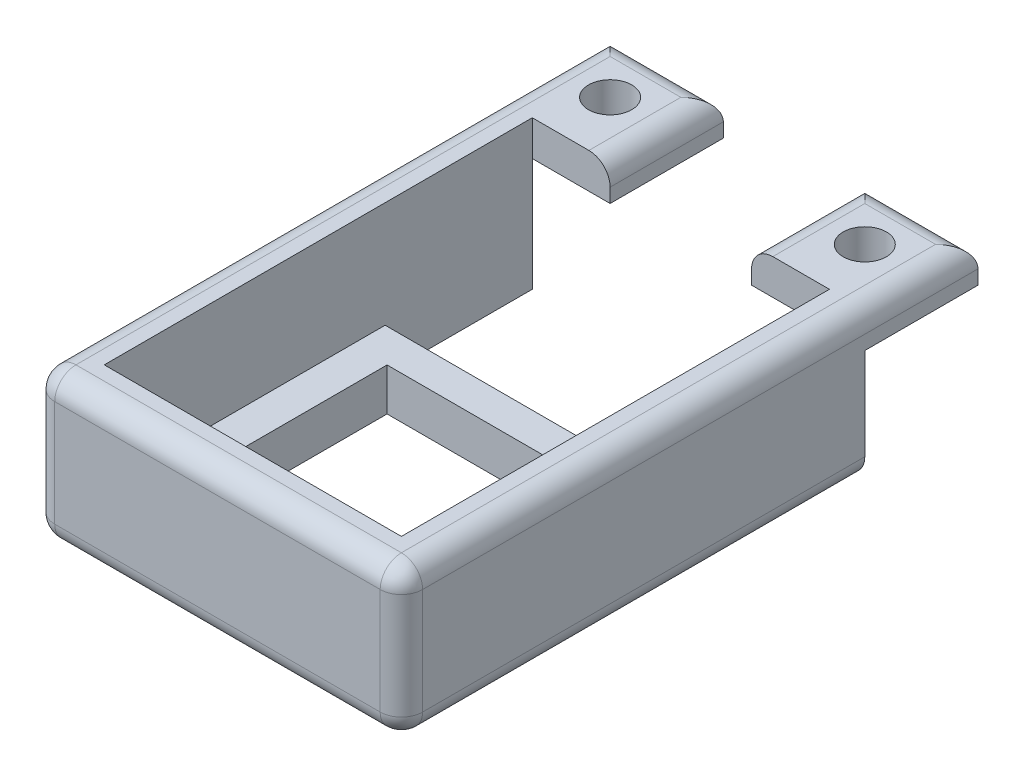
ISO-10303-21;
HEADER;
FILE_DESCRIPTION(('STEP AP214'),'2;1');
FILE_NAME('part.step','',(''),(''),'','','');
FILE_SCHEMA(('AUTOMOTIVE_DESIGN { 1 0 10303 214 1 1 1 1 }'));
ENDSEC;
DATA;
#1=APPLICATION_CONTEXT('core data for automotive mechanical design processes');
#2=APPLICATION_PROTOCOL_DEFINITION('international standard','automotive_design',2000,#1);
#3=PRODUCT_CONTEXT('',#1,'mechanical');
#4=PRODUCT('Part','Part','',(#3));
#5=PRODUCT_RELATED_PRODUCT_CATEGORY('part','',(#4));
#6=PRODUCT_DEFINITION_FORMATION('','',#4);
#7=PRODUCT_DEFINITION_CONTEXT('part definition',#1,'design');
#8=PRODUCT_DEFINITION('design','',#6,#7);
#9=PRODUCT_DEFINITION_SHAPE('','',#8);
#10=(LENGTH_UNIT() NAMED_UNIT(*) SI_UNIT(.MILLI.,.METRE.));
#11=(NAMED_UNIT(*) PLANE_ANGLE_UNIT() SI_UNIT($,.RADIAN.));
#12=(NAMED_UNIT(*) SI_UNIT($,.STERADIAN.) SOLID_ANGLE_UNIT());
#13=UNCERTAINTY_MEASURE_WITH_UNIT(LENGTH_MEASURE(1.E-05),#10,'distance_accuracy_value','');
#14=(GEOMETRIC_REPRESENTATION_CONTEXT(3) GLOBAL_UNCERTAINTY_ASSIGNED_CONTEXT((#13)) GLOBAL_UNIT_ASSIGNED_CONTEXT((#10,
#11,#12)) REPRESENTATION_CONTEXT('',''));
#15=CARTESIAN_POINT('',(0.,0.,0.));
#16=DIRECTION('',(0.,0.,1.));
#17=DIRECTION('',(1.,0.,0.));
#18=AXIS2_PLACEMENT_3D('',#15,#16,#17);
#19=CARTESIAN_POINT('',(16.,6.,0.));
#20=DIRECTION('',(-1.,0.,0.));
#21=DIRECTION('',(0.,0.,1.));
#22=AXIS2_PLACEMENT_3D('',#19,#20,#21);
#23=PLANE('',#22);
#24=DIRECTION('',(0.,0.,-1.));
#25=VECTOR('',#24,1.);
#26=CARTESIAN_POINT('',(16.,0.,0.));
#27=LINE('',#26,#25);
#28=CARTESIAN_POINT('',(16.,0.,15.1238095238095));
#29=VERTEX_POINT('',#28);
#30=CARTESIAN_POINT('',(16.,0.,-15.1238095238095));
#31=VERTEX_POINT('',#30);
#32=EDGE_CURVE('E370',#29,#31,#27,.T.);
#33=ORIENTED_EDGE('',*,*,#32,.F.);
#34=DIRECTION('',(0.,-1.,0.));
#35=VECTOR('',#34,1.);
#36=CARTESIAN_POINT('',(16.,6.,15.1238095238095));
#37=LINE('',#36,#35);
#38=CARTESIAN_POINT('',(16.,6.,15.1238095238095));
#39=VERTEX_POINT('',#38);
#40=EDGE_CURVE('E389',#39,#29,#37,.T.);
#41=ORIENTED_EDGE('',*,*,#40,.F.);
#42=DIRECTION('',(0.,0.,-1.));
#43=VECTOR('',#42,1.);
#44=CARTESIAN_POINT('',(16.,6.,0.));
#45=LINE('',#44,#43);
#46=CARTESIAN_POINT('',(16.,6.,-15.1238095238095));
#47=VERTEX_POINT('',#46);
#48=EDGE_CURVE('E344',#39,#47,#45,.T.);
#49=ORIENTED_EDGE('',*,*,#48,.T.);
#50=DIRECTION('',(0.,-1.,0.));
#51=VECTOR('',#50,1.);
#52=CARTESIAN_POINT('',(16.,6.,-15.1238095238095));
#53=LINE('',#52,#51);
#54=EDGE_CURVE('E381',#47,#31,#53,.T.);
#55=ORIENTED_EDGE('',*,*,#54,.T.);
#56=EDGE_LOOP('',(#33,#41,#49,#55));
#57=FACE_BOUND('',#56,.T.);
#58=ADVANCED_FACE('F67',(#57),#23,.T.);
#59=CARTESIAN_POINT('',(0.,6.,15.1238095238095));
#60=DIRECTION('',(0.,0.,-1.));
#61=DIRECTION('',(-1.,0.,0.));
#62=AXIS2_PLACEMENT_3D('',#59,#60,#61);
#63=PLANE('',#62);
#64=DIRECTION('',(1.,0.,0.));
#65=VECTOR('',#64,1.);
#66=CARTESIAN_POINT('',(0.,0.,15.1238095238095));
#67=LINE('',#66,#65);
#68=CARTESIAN_POINT('',(-16.,0.,15.1238095238095));
#69=VERTEX_POINT('',#68);
#70=EDGE_CURVE('E373',#69,#29,#67,.T.);
#71=ORIENTED_EDGE('',*,*,#70,.F.);
#72=DIRECTION('',(0.,-1.,0.));
#73=VECTOR('',#72,1.);
#74=CARTESIAN_POINT('',(-16.,6.,15.1238095238095));
#75=LINE('',#74,#73);
#76=CARTESIAN_POINT('',(-16.,6.,15.1238095238095));
#77=VERTEX_POINT('',#76);
#78=EDGE_CURVE('E387',#77,#69,#75,.T.);
#79=ORIENTED_EDGE('',*,*,#78,.F.);
#80=DIRECTION('',(1.,0.,0.));
#81=VECTOR('',#80,1.);
#82=CARTESIAN_POINT('',(0.,6.,15.1238095238095));
#83=LINE('',#82,#81);
#84=EDGE_CURVE('E348',#77,#39,#83,.T.);
#85=ORIENTED_EDGE('',*,*,#84,.T.);
#86=ORIENTED_EDGE('',*,*,#40,.T.);
#87=EDGE_LOOP('',(#71,#79,#85,#86));
#88=FACE_BOUND('',#87,.T.);
#89=ADVANCED_FACE('F624',(#88),#63,.T.);
#90=CARTESIAN_POINT('',(-16.,6.,0.));
#91=DIRECTION('',(-1.,0.,0.));
#92=DIRECTION('',(0.,0.,1.));
#93=AXIS2_PLACEMENT_3D('',#90,#91,#92);
#94=PLANE('',#93);
#95=DIRECTION('',(0.,0.,-1.));
#96=VECTOR('',#95,1.);
#97=CARTESIAN_POINT('',(-16.,0.,0.));
#98=LINE('',#97,#96);
#99=CARTESIAN_POINT('',(-16.,0.,-15.1238095238095));
#100=VERTEX_POINT('',#99);
#101=EDGE_CURVE('E376',#69,#100,#98,.T.);
#102=ORIENTED_EDGE('',*,*,#101,.T.);
#103=DIRECTION('',(0.,-1.,0.));
#104=VECTOR('',#103,1.);
#105=CARTESIAN_POINT('',(-16.,6.,-15.1238095238095));
#106=LINE('',#105,#104);
#107=CARTESIAN_POINT('',(-16.,6.,-15.1238095238095));
#108=VERTEX_POINT('',#107);
#109=EDGE_CURVE('E383',#108,#100,#106,.T.);
#110=ORIENTED_EDGE('',*,*,#109,.F.);
#111=DIRECTION('',(0.,0.,-1.));
#112=VECTOR('',#111,1.);
#113=CARTESIAN_POINT('',(-16.,6.,0.));
#114=LINE('',#113,#112);
#115=EDGE_CURVE('E351',#77,#108,#114,.T.);
#116=ORIENTED_EDGE('',*,*,#115,.F.);
#117=ORIENTED_EDGE('',*,*,#78,.T.);
#118=EDGE_LOOP('',(#102,#110,#116,#117));
#119=FACE_BOUND('',#118,.T.);
#120=ADVANCED_FACE('F630',(#119),#94,.F.);
#121=CARTESIAN_POINT('',(21.,6.,0.));
#122=DIRECTION('',(-1.,0.,0.));
#123=DIRECTION('',(0.,0.,1.));
#124=AXIS2_PLACEMENT_3D('',#121,#122,#123);
#125=PLANE('',#124);
#126=DIRECTION('',(0.,0.,-1.));
#127=VECTOR('',#126,1.);
#128=CARTESIAN_POINT('',(21.,0.,0.));
#129=LINE('',#128,#127);
#130=CARTESIAN_POINT('',(21.,0.,-19.85));
#131=VERTEX_POINT('',#130);
#132=CARTESIAN_POINT('',(21.,0.,-40.65));
#133=VERTEX_POINT('',#132);
#134=EDGE_CURVE('E340',#131,#133,#129,.T.);
#135=ORIENTED_EDGE('',*,*,#134,.F.);
#136=DIRECTION('',(0.,-1.,0.));
#137=VECTOR('',#136,1.);
#138=CARTESIAN_POINT('',(21.,6.,-19.85));
#139=LINE('',#138,#137);
#140=CARTESIAN_POINT('',(21.,6.,-19.85));
#141=VERTEX_POINT('',#140);
#142=EDGE_CURVE('E384',#141,#131,#139,.T.);
#143=ORIENTED_EDGE('',*,*,#142,.F.);
#144=DIRECTION('',(0.,0.,1.));
#145=VECTOR('',#144,1.);
#146=CARTESIAN_POINT('',(21.,6.,0.));
#147=LINE('',#146,#145);
#148=CARTESIAN_POINT('',(21.,6.,19.85));
#149=VERTEX_POINT('',#148);
#150=EDGE_CURVE('E338',#141,#149,#147,.T.);
#151=ORIENTED_EDGE('',*,*,#150,.T.);
#152=DIRECTION('',(0.,-1.,0.));
#153=VECTOR('',#152,1.);
#154=CARTESIAN_POINT('',(21.,21.,19.85));
#155=LINE('',#154,#153);
#156=CARTESIAN_POINT('',(21.,21.,19.85));
#157=VERTEX_POINT('',#156);
#158=EDGE_CURVE('E330',#157,#149,#155,.T.);
#159=ORIENTED_EDGE('',*,*,#158,.F.);
#160=DIRECTION('',(0.,0.,-1.));
#161=VECTOR('',#160,1.);
#162=CARTESIAN_POINT('',(21.,21.,0.));
#163=LINE('',#162,#161);
#164=CARTESIAN_POINT('',(21.,21.,-40.65));
#165=VERTEX_POINT('',#164);
#166=EDGE_CURVE('E319',#157,#165,#163,.T.);
#167=ORIENTED_EDGE('',*,*,#166,.T.);
#168=DIRECTION('',(0.,-1.,0.));
#169=VECTOR('',#168,1.);
#170=CARTESIAN_POINT('',(21.,6.,-40.65));
#171=LINE('',#170,#169);
#172=CARTESIAN_POINT('',(21.,16.,-40.65));
#173=VERTEX_POINT('',#172);
#174=EDGE_CURVE('E392',#165,#173,#171,.T.);
#175=ORIENTED_EDGE('',*,*,#174,.T.);
#176=EDGE_CURVE('E356',#173,#133,#171,.T.);
#177=ORIENTED_EDGE('',*,*,#176,.T.);
#178=EDGE_LOOP('',(#135,#143,#151,#159,#167,#175,#177));
#179=FACE_BOUND('',#178,.T.);
#180=ADVANCED_FACE('F541',(#179),#125,.T.);
#181=CARTESIAN_POINT('',(0.,6.,-19.85));
#182=DIRECTION('',(0.,0.,-1.));
#183=DIRECTION('',(-1.,0.,0.));
#184=AXIS2_PLACEMENT_3D('',#181,#182,#183);
#185=PLANE('',#184);
#186=DIRECTION('',(1.,0.,0.));
#187=VECTOR('',#186,1.);
#188=CARTESIAN_POINT('',(0.,0.,-19.85));
#189=LINE('',#188,#187);
#190=CARTESIAN_POINT('',(-21.,0.,-19.85));
#191=VERTEX_POINT('',#190);
#192=EDGE_CURVE('E359',#191,#131,#189,.T.);
#193=ORIENTED_EDGE('',*,*,#192,.F.);
#194=DIRECTION('',(0.,-1.,0.));
#195=VECTOR('',#194,1.);
#196=CARTESIAN_POINT('',(-21.,6.,-19.85));
#197=LINE('',#196,#195);
#198=CARTESIAN_POINT('',(-21.,6.,-19.85));
#199=VERTEX_POINT('',#198);
#200=EDGE_CURVE('E405',#199,#191,#197,.T.);
#201=ORIENTED_EDGE('',*,*,#200,.F.);
#202=DIRECTION('',(1.,0.,0.));
#203=VECTOR('',#202,1.);
#204=CARTESIAN_POINT('',(0.,6.,-19.85));
#205=LINE('',#204,#203);
#206=EDGE_CURVE('E341',#199,#141,#205,.T.);
#207=ORIENTED_EDGE('',*,*,#206,.T.);
#208=ORIENTED_EDGE('',*,*,#142,.T.);
#209=EDGE_LOOP('',(#193,#201,#207,#208));
#210=FACE_BOUND('',#209,.T.);
#211=ADVANCED_FACE('F606',(#210),#185,.T.);
#212=CARTESIAN_POINT('',(-21.,6.,0.));
#213=DIRECTION('',(-1.,0.,0.));
#214=DIRECTION('',(0.,0.,1.));
#215=AXIS2_PLACEMENT_3D('',#212,#213,#214);
#216=PLANE('',#215);
#217=DIRECTION('',(0.,0.,-1.));
#218=VECTOR('',#217,1.);
#219=CARTESIAN_POINT('',(-21.,0.,0.));
#220=LINE('',#219,#218);
#221=CARTESIAN_POINT('',(-21.,0.,-40.65));
#222=VERTEX_POINT('',#221);
#223=EDGE_CURVE('E362',#191,#222,#220,.T.);
#224=ORIENTED_EDGE('',*,*,#223,.T.);
#225=DIRECTION('',(0.,-1.,0.));
#226=VECTOR('',#225,1.);
#227=CARTESIAN_POINT('',(-21.,6.,-40.65));
#228=LINE('',#227,#226);
#229=CARTESIAN_POINT('',(-21.,16.,-40.65));
#230=VERTEX_POINT('',#229);
#231=EDGE_CURVE('E401',#230,#222,#228,.T.);
#232=ORIENTED_EDGE('',*,*,#231,.F.);
#233=CARTESIAN_POINT('',(-21.,21.,-40.65));
#234=VERTEX_POINT('',#233);
#235=EDGE_CURVE('E402',#234,#230,#228,.T.);
#236=ORIENTED_EDGE('',*,*,#235,.F.);
#237=DIRECTION('',(0.,0.,-1.));
#238=VECTOR('',#237,1.);
#239=CARTESIAN_POINT('',(-21.,21.,0.));
#240=LINE('',#239,#238);
#241=CARTESIAN_POINT('',(-21.,21.,19.85));
#242=VERTEX_POINT('',#241);
#243=EDGE_CURVE('E324',#242,#234,#240,.T.);
#244=ORIENTED_EDGE('',*,*,#243,.F.);
#245=DIRECTION('',(0.,-1.,0.));
#246=VECTOR('',#245,1.);
#247=CARTESIAN_POINT('',(-21.,21.,19.85));
#248=LINE('',#247,#246);
#249=CARTESIAN_POINT('',(-21.,6.,19.85));
#250=VERTEX_POINT('',#249);
#251=EDGE_CURVE('E327',#242,#250,#248,.T.);
#252=ORIENTED_EDGE('',*,*,#251,.T.);
#253=DIRECTION('',(0.,0.,1.));
#254=VECTOR('',#253,1.);
#255=CARTESIAN_POINT('',(-21.,6.,0.));
#256=LINE('',#255,#254);
#257=EDGE_CURVE('E333',#199,#250,#256,.T.);
#258=ORIENTED_EDGE('',*,*,#257,.F.);
#259=ORIENTED_EDGE('',*,*,#200,.T.);
#260=EDGE_LOOP('',(#224,#232,#236,#244,#252,#258,#259));
#261=FACE_BOUND('',#260,.T.);
#262=ADVANCED_FACE('F601',(#261),#216,.F.);
#263=CARTESIAN_POINT('',(0.,6.,-40.65));
#264=DIRECTION('',(0.,0.,-1.));
#265=DIRECTION('',(-1.,0.,0.));
#266=AXIS2_PLACEMENT_3D('',#263,#264,#265);
#267=PLANE('',#266);
#268=DIRECTION('',(1.,0.,0.));
#269=VECTOR('',#268,1.);
#270=CARTESIAN_POINT('',(0.,0.,-40.65));
#271=LINE('',#270,#269);
#272=CARTESIAN_POINT('',(-23.,0.,-40.65));
#273=VERTEX_POINT('',#272);
#274=EDGE_CURVE('E365',#273,#222,#271,.T.);
#275=ORIENTED_EDGE('',*,*,#274,.F.);
#276=CARTESIAN_POINT('',(-23.,3.,-40.65));
#277=DIRECTION('',(0.,0.,-1.));
#278=DIRECTION('',(-1.,0.,0.));
#279=AXIS2_PLACEMENT_3D('',#276,#277,#278);
#280=CIRCLE('',#279,3.);
#281=CARTESIAN_POINT('',(-26.,3.,-40.65));
#282=VERTEX_POINT('',#281);
#283=EDGE_CURVE('E420',#273,#282,#280,.T.);
#284=ORIENTED_EDGE('',*,*,#283,.T.);
#285=DIRECTION('',(0.,-1.,0.));
#286=VECTOR('',#285,1.);
#287=CARTESIAN_POINT('',(-26.,6.,-40.65));
#288=LINE('',#287,#286);
#289=CARTESIAN_POINT('',(-26.,16.,-40.65));
#290=VERTEX_POINT('',#289);
#291=EDGE_CURVE('E398',#290,#282,#288,.T.);
#292=ORIENTED_EDGE('',*,*,#291,.F.);
#293=DIRECTION('',(-1.,0.,0.));
#294=VECTOR('',#293,1.);
#295=CARTESIAN_POINT('',(0.,16.,-40.65));
#296=LINE('',#295,#294);
#297=EDGE_CURVE('E303',#230,#290,#296,.T.);
#298=ORIENTED_EDGE('',*,*,#297,.F.);
#299=ORIENTED_EDGE('',*,*,#231,.T.);
#300=EDGE_LOOP('',(#275,#284,#292,#298,#299));
#301=FACE_BOUND('',#300,.T.);
#302=ADVANCED_FACE('F588',(#301),#267,.T.);
#303=CARTESIAN_POINT('',(-26.,6.,0.));
#304=DIRECTION('',(1.,0.,0.));
#305=DIRECTION('',(0.,0.,-1.));
#306=AXIS2_PLACEMENT_3D('',#303,#304,#305);
#307=PLANE('',#306);
#308=ORIENTED_EDGE('',*,*,#291,.T.);
#309=DIRECTION('',(0.,0.,1.));
#310=VECTOR('',#309,1.);
#311=CARTESIAN_POINT('',(-26.,3.,0.));
#312=LINE('',#311,#310);
#313=CARTESIAN_POINT('',(-26.,3.,21.85));
#314=VERTEX_POINT('',#313);
#315=EDGE_CURVE('E411',#282,#314,#312,.T.);
#316=ORIENTED_EDGE('',*,*,#315,.T.);
#317=DIRECTION('',(0.,-1.,0.));
#318=VECTOR('',#317,1.);
#319=CARTESIAN_POINT('',(-26.,6.,21.85));
#320=LINE('',#319,#318);
#321=CARTESIAN_POINT('',(-26.,18.,21.85));
#322=VERTEX_POINT('',#321);
#323=EDGE_CURVE('E391',#314,#322,#320,.F.);
#324=ORIENTED_EDGE('',*,*,#323,.T.);
#325=DIRECTION('',(0.,0.,1.));
#326=VECTOR('',#325,1.);
#327=CARTESIAN_POINT('',(-26.,18.,-56.65));
#328=LINE('',#327,#326);
#329=CARTESIAN_POINT('',(-26.,18.,-56.65));
#330=VERTEX_POINT('',#329);
#331=EDGE_CURVE('E409',#322,#330,#328,.F.);
#332=ORIENTED_EDGE('',*,*,#331,.T.);
#333=DIRECTION('',(0.,1.,0.));
#334=VECTOR('',#333,1.);
#335=CARTESIAN_POINT('',(-26.,16.,-56.65));
#336=LINE('',#335,#334);
#337=CARTESIAN_POINT('',(-26.,16.,-56.65));
#338=VERTEX_POINT('',#337);
#339=EDGE_CURVE('E314',#338,#330,#336,.T.);
#340=ORIENTED_EDGE('',*,*,#339,.F.);
#341=DIRECTION('',(0.,0.,-1.));
#342=VECTOR('',#341,1.);
#343=CARTESIAN_POINT('',(-26.,16.,0.));
#344=LINE('',#343,#342);
#345=EDGE_CURVE('E307',#290,#338,#344,.T.);
#346=ORIENTED_EDGE('',*,*,#345,.F.);
#347=EDGE_LOOP('',(#308,#316,#324,#332,#340,#346));
#348=FACE_BOUND('',#347,.T.);
#349=ADVANCED_FACE('F583',(#348),#307,.F.);
#350=CARTESIAN_POINT('',(0.,6.,24.85));
#351=DIRECTION('',(0.,0.,-1.));
#352=DIRECTION('',(-1.,0.,0.));
#353=AXIS2_PLACEMENT_3D('',#350,#351,#352);
#354=PLANE('',#353);
#355=DIRECTION('',(1.,0.,0.));
#356=VECTOR('',#355,1.);
#357=CARTESIAN_POINT('',(-26.,18.,24.85));
#358=LINE('',#357,#356);
#359=CARTESIAN_POINT('',(23.,18.,24.85));
#360=VERTEX_POINT('',#359);
#361=CARTESIAN_POINT('',(-23.,18.,24.85));
#362=VERTEX_POINT('',#361);
#363=EDGE_CURVE('E432',#360,#362,#358,.F.);
#364=ORIENTED_EDGE('',*,*,#363,.T.);
#365=DIRECTION('',(0.,-1.,0.));
#366=VECTOR('',#365,1.);
#367=CARTESIAN_POINT('',(-23.,6.,24.85));
#368=LINE('',#367,#366);
#369=CARTESIAN_POINT('',(-23.,3.,24.85));
#370=VERTEX_POINT('',#369);
#371=EDGE_CURVE('E437',#362,#370,#368,.T.);
#372=ORIENTED_EDGE('',*,*,#371,.T.);
#373=DIRECTION('',(1.,0.,0.));
#374=VECTOR('',#373,1.);
#375=CARTESIAN_POINT('',(0.,3.,24.85));
#376=LINE('',#375,#374);
#377=CARTESIAN_POINT('',(23.,3.,24.85));
#378=VERTEX_POINT('',#377);
#379=EDGE_CURVE('E434',#370,#378,#376,.T.);
#380=ORIENTED_EDGE('',*,*,#379,.T.);
#381=DIRECTION('',(0.,-1.,0.));
#382=VECTOR('',#381,1.);
#383=CARTESIAN_POINT('',(23.,6.,24.85));
#384=LINE('',#383,#382);
#385=EDGE_CURVE('E430',#378,#360,#384,.F.);
#386=ORIENTED_EDGE('',*,*,#385,.T.);
#387=EDGE_LOOP('',(#364,#372,#380,#386));
#388=FACE_BOUND('',#387,.T.);
#389=ADVANCED_FACE('F652',(#388),#354,.F.);
#390=CARTESIAN_POINT('',(26.,6.,0.));
#391=DIRECTION('',(-1.,0.,0.));
#392=DIRECTION('',(0.,0.,1.));
#393=AXIS2_PLACEMENT_3D('',#390,#391,#392);
#394=PLANE('',#393);
#395=DIRECTION('',(0.,-1.,0.));
#396=VECTOR('',#395,1.);
#397=CARTESIAN_POINT('',(26.,6.,21.85));
#398=LINE('',#397,#396);
#399=CARTESIAN_POINT('',(26.,18.,21.85));
#400=VERTEX_POINT('',#399);
#401=CARTESIAN_POINT('',(26.,3.,21.85));
#402=VERTEX_POINT('',#401);
#403=EDGE_CURVE('E422',#400,#402,#398,.T.);
#404=ORIENTED_EDGE('',*,*,#403,.T.);
#405=DIRECTION('',(0.,0.,-1.));
#406=VECTOR('',#405,1.);
#407=CARTESIAN_POINT('',(26.,3.,0.));
#408=LINE('',#407,#406);
#409=CARTESIAN_POINT('',(26.,3.,-40.65));
#410=VERTEX_POINT('',#409);
#411=EDGE_CURVE('E426',#402,#410,#408,.T.);
#412=ORIENTED_EDGE('',*,*,#411,.T.);
#413=DIRECTION('',(0.,-1.,0.));
#414=VECTOR('',#413,1.);
#415=CARTESIAN_POINT('',(26.,6.,-40.65));
#416=LINE('',#415,#414);
#417=CARTESIAN_POINT('',(26.,16.,-40.65));
#418=VERTEX_POINT('',#417);
#419=EDGE_CURVE('E395',#418,#410,#416,.T.);
#420=ORIENTED_EDGE('',*,*,#419,.F.);
#421=DIRECTION('',(0.,0.,1.));
#422=VECTOR('',#421,1.);
#423=CARTESIAN_POINT('',(26.,16.,0.));
#424=LINE('',#423,#422);
#425=CARTESIAN_POINT('',(26.,16.,-56.65));
#426=VERTEX_POINT('',#425);
#427=EDGE_CURVE('E270',#426,#418,#424,.T.);
#428=ORIENTED_EDGE('',*,*,#427,.F.);
#429=DIRECTION('',(0.,1.,0.));
#430=VECTOR('',#429,1.);
#431=CARTESIAN_POINT('',(26.,16.,-56.65));
#432=LINE('',#431,#430);
#433=CARTESIAN_POINT('',(26.,18.,-56.65));
#434=VERTEX_POINT('',#433);
#435=EDGE_CURVE('E284',#426,#434,#432,.T.);
#436=ORIENTED_EDGE('',*,*,#435,.T.);
#437=DIRECTION('',(0.,0.,-1.));
#438=VECTOR('',#437,1.);
#439=CARTESIAN_POINT('',(26.,18.,24.85));
#440=LINE('',#439,#438);
#441=EDGE_CURVE('E424',#434,#400,#440,.F.);
#442=ORIENTED_EDGE('',*,*,#441,.T.);
#443=EDGE_LOOP('',(#404,#412,#420,#428,#436,#442));
#444=FACE_BOUND('',#443,.T.);
#445=ADVANCED_FACE('F522',(#444),#394,.F.);
#446=CARTESIAN_POINT('',(0.,6.,-40.65));
#447=DIRECTION('',(0.,0.,-1.));
#448=DIRECTION('',(-1.,0.,0.));
#449=AXIS2_PLACEMENT_3D('',#446,#447,#448);
#450=PLANE('',#449);
#451=ORIENTED_EDGE('',*,*,#419,.T.);
#452=CARTESIAN_POINT('',(23.,3.,-40.65));
#453=DIRECTION('',(0.,0.,-1.));
#454=DIRECTION('',(-1.,0.,0.));
#455=AXIS2_PLACEMENT_3D('',#452,#453,#454);
#456=CIRCLE('',#455,3.);
#457=CARTESIAN_POINT('',(23.,0.,-40.65));
#458=VERTEX_POINT('',#457);
#459=EDGE_CURVE('E428',#410,#458,#456,.T.);
#460=ORIENTED_EDGE('',*,*,#459,.T.);
#461=DIRECTION('',(1.,0.,0.));
#462=VECTOR('',#461,1.);
#463=CARTESIAN_POINT('',(0.,0.,-40.65));
#464=LINE('',#463,#462);
#465=EDGE_CURVE('E367',#133,#458,#464,.T.);
#466=ORIENTED_EDGE('',*,*,#465,.F.);
#467=ORIENTED_EDGE('',*,*,#176,.F.);
#468=DIRECTION('',(-1.,0.,0.));
#469=VECTOR('',#468,1.);
#470=CARTESIAN_POINT('',(0.,16.,-40.65));
#471=LINE('',#470,#469);
#472=EDGE_CURVE('E268',#418,#173,#471,.T.);
#473=ORIENTED_EDGE('',*,*,#472,.F.);
#474=EDGE_LOOP('',(#451,#460,#466,#467,#473));
#475=FACE_BOUND('',#474,.T.);
#476=ADVANCED_FACE('F526',(#475),#450,.T.);
#477=CARTESIAN_POINT('',(0.,6.,-15.1238095238095));
#478=DIRECTION('',(0.,0.,-1.));
#479=DIRECTION('',(-1.,0.,0.));
#480=AXIS2_PLACEMENT_3D('',#477,#478,#479);
#481=PLANE('',#480);
#482=DIRECTION('',(1.,0.,0.));
#483=VECTOR('',#482,1.);
#484=CARTESIAN_POINT('',(0.,0.,-15.1238095238095));
#485=LINE('',#484,#483);
#486=EDGE_CURVE('E345',#100,#31,#485,.T.);
#487=ORIENTED_EDGE('',*,*,#486,.T.);
#488=ORIENTED_EDGE('',*,*,#54,.F.);
#489=DIRECTION('',(1.,0.,0.));
#490=VECTOR('',#489,1.);
#491=CARTESIAN_POINT('',(0.,6.,-15.1238095238095));
#492=LINE('',#491,#490);
#493=EDGE_CURVE('E354',#108,#47,#492,.T.);
#494=ORIENTED_EDGE('',*,*,#493,.F.);
#495=ORIENTED_EDGE('',*,*,#109,.T.);
#496=EDGE_LOOP('',(#487,#488,#494,#495));
#497=FACE_BOUND('',#496,.T.);
#498=ADVANCED_FACE('F616',(#497),#481,.F.);
#499=CARTESIAN_POINT('',(0.,6.,0.));
#500=DIRECTION('',(0.,1.,0.));
#501=DIRECTION('',(0.,0.,1.));
#502=AXIS2_PLACEMENT_3D('',#499,#500,#501);
#503=PLANE('',#502);
#504=ORIENTED_EDGE('',*,*,#150,.F.);
#505=ORIENTED_EDGE('',*,*,#206,.F.);
#506=ORIENTED_EDGE('',*,*,#257,.T.);
#507=DIRECTION('',(-1.,0.,0.));
#508=VECTOR('',#507,1.);
#509=CARTESIAN_POINT('',(0.,6.,19.85));
#510=LINE('',#509,#508);
#511=EDGE_CURVE('E336',#149,#250,#510,.T.);
#512=ORIENTED_EDGE('',*,*,#511,.F.);
#513=EDGE_LOOP('',(#504,#505,#506,#512));
#514=FACE_BOUND('',#513,.T.);
#515=ORIENTED_EDGE('',*,*,#48,.F.);
#516=ORIENTED_EDGE('',*,*,#84,.F.);
#517=ORIENTED_EDGE('',*,*,#115,.T.);
#518=ORIENTED_EDGE('',*,*,#493,.T.);
#519=EDGE_LOOP('',(#515,#516,#517,#518));
#520=FACE_BOUND('',#519,.T.);
#521=ADVANCED_FACE('F613',(#514,#520),#503,.T.);
#522=CARTESIAN_POINT('',(0.,0.,0.));
#523=DIRECTION('',(0.,1.,0.));
#524=DIRECTION('',(0.,0.,1.));
#525=AXIS2_PLACEMENT_3D('',#522,#523,#524);
#526=PLANE('',#525);
#527=DIRECTION('',(1.,0.,0.));
#528=VECTOR('',#527,1.);
#529=CARTESIAN_POINT('',(0.,0.,21.85));
#530=LINE('',#529,#528);
#531=CARTESIAN_POINT('',(23.,0.,21.85));
#532=VERTEX_POINT('',#531);
#533=CARTESIAN_POINT('',(-23.,0.,21.85));
#534=VERTEX_POINT('',#533);
#535=EDGE_CURVE('E414',#532,#534,#530,.F.);
#536=ORIENTED_EDGE('',*,*,#535,.T.);
#537=DIRECTION('',(0.,0.,1.));
#538=VECTOR('',#537,1.);
#539=CARTESIAN_POINT('',(-23.,0.,0.));
#540=LINE('',#539,#538);
#541=EDGE_CURVE('E418',#534,#273,#540,.F.);
#542=ORIENTED_EDGE('',*,*,#541,.T.);
#543=ORIENTED_EDGE('',*,*,#274,.T.);
#544=ORIENTED_EDGE('',*,*,#223,.F.);
#545=ORIENTED_EDGE('',*,*,#192,.T.);
#546=ORIENTED_EDGE('',*,*,#134,.T.);
#547=ORIENTED_EDGE('',*,*,#465,.T.);
#548=DIRECTION('',(0.,0.,-1.));
#549=VECTOR('',#548,1.);
#550=CARTESIAN_POINT('',(23.,0.,0.));
#551=LINE('',#550,#549);
#552=EDGE_CURVE('E416',#458,#532,#551,.F.);
#553=ORIENTED_EDGE('',*,*,#552,.T.);
#554=EDGE_LOOP('',(#536,#542,#543,#544,#545,#546,#547,#553));
#555=FACE_BOUND('',#554,.T.);
#556=ORIENTED_EDGE('',*,*,#32,.T.);
#557=ORIENTED_EDGE('',*,*,#486,.F.);
#558=ORIENTED_EDGE('',*,*,#101,.F.);
#559=ORIENTED_EDGE('',*,*,#70,.T.);
#560=EDGE_LOOP('',(#556,#557,#558,#559));
#561=FACE_BOUND('',#560,.T.);
#562=ADVANCED_FACE('F535',(#555,#561),#526,.F.);
#563=CARTESIAN_POINT('',(0.,21.,19.85));
#564=DIRECTION('',(0.,0.,-1.));
#565=DIRECTION('',(-1.,0.,0.));
#566=AXIS2_PLACEMENT_3D('',#563,#564,#565);
#567=PLANE('',#566);
#568=ORIENTED_EDGE('',*,*,#158,.T.);
#569=ORIENTED_EDGE('',*,*,#511,.T.);
#570=ORIENTED_EDGE('',*,*,#251,.F.);
#571=DIRECTION('',(1.,0.,0.));
#572=VECTOR('',#571,1.);
#573=CARTESIAN_POINT('',(0.,21.,19.85));
#574=LINE('',#573,#572);
#575=EDGE_CURVE('E321',#242,#157,#574,.T.);
#576=ORIENTED_EDGE('',*,*,#575,.T.);
#577=EDGE_LOOP('',(#568,#569,#570,#576));
#578=FACE_BOUND('',#577,.T.);
#579=ADVANCED_FACE('F612',(#578),#567,.T.);
#580=CARTESIAN_POINT('',(0.,21.,0.));
#581=DIRECTION('',(0.,1.,0.));
#582=DIRECTION('',(0.,0.,1.));
#583=AXIS2_PLACEMENT_3D('',#580,#581,#582);
#584=PLANE('',#583);
#585=DIRECTION('',(1.,0.,0.));
#586=VECTOR('',#585,1.);
#587=CARTESIAN_POINT('',(9.99999999999999,21.,-53.65));
#588=LINE('',#587,#586);
#589=CARTESIAN_POINT('',(23.,21.,-53.65));
#590=VERTEX_POINT('',#589);
#591=CARTESIAN_POINT('',(13.,21.,-53.65));
#592=VERTEX_POINT('',#591);
#593=EDGE_CURVE('E449',#590,#592,#588,.F.);
#594=ORIENTED_EDGE('',*,*,#593,.T.);
#595=DIRECTION('',(0.,0.,-1.));
#596=VECTOR('',#595,1.);
#597=CARTESIAN_POINT('',(13.,21.,-40.65));
#598=LINE('',#597,#596);
#599=CARTESIAN_POINT('',(13.,21.,-40.65));
#600=VERTEX_POINT('',#599);
#601=EDGE_CURVE('E451',#592,#600,#598,.F.);
#602=ORIENTED_EDGE('',*,*,#601,.T.);
#603=DIRECTION('',(-1.,0.,0.));
#604=VECTOR('',#603,1.);
#605=CARTESIAN_POINT('',(0.,21.,-40.65));
#606=LINE('',#605,#604);
#607=EDGE_CURVE('E288',#165,#600,#606,.T.);
#608=ORIENTED_EDGE('',*,*,#607,.F.);
#609=ORIENTED_EDGE('',*,*,#166,.F.);
#610=ORIENTED_EDGE('',*,*,#575,.F.);
#611=ORIENTED_EDGE('',*,*,#243,.T.);
#612=DIRECTION('',(-1.,0.,0.));
#613=VECTOR('',#612,1.);
#614=CARTESIAN_POINT('',(0.,21.,-40.65));
#615=LINE('',#614,#613);
#616=CARTESIAN_POINT('',(-13.,21.,-40.65));
#617=VERTEX_POINT('',#616);
#618=EDGE_CURVE('E297',#617,#234,#615,.T.);
#619=ORIENTED_EDGE('',*,*,#618,.F.);
#620=DIRECTION('',(0.,0.,1.));
#621=VECTOR('',#620,1.);
#622=CARTESIAN_POINT('',(-13.,21.,-56.65));
#623=LINE('',#622,#621);
#624=CARTESIAN_POINT('',(-13.,21.,-53.65));
#625=VERTEX_POINT('',#624);
#626=EDGE_CURVE('E439',#617,#625,#623,.F.);
#627=ORIENTED_EDGE('',*,*,#626,.T.);
#628=DIRECTION('',(1.,0.,0.));
#629=VECTOR('',#628,1.);
#630=CARTESIAN_POINT('',(-26.,21.,-53.65));
#631=LINE('',#630,#629);
#632=CARTESIAN_POINT('',(-23.,21.,-53.65));
#633=VERTEX_POINT('',#632);
#634=EDGE_CURVE('E441',#625,#633,#631,.F.);
#635=ORIENTED_EDGE('',*,*,#634,.T.);
#636=DIRECTION('',(0.,0.,1.));
#637=VECTOR('',#636,1.);
#638=CARTESIAN_POINT('',(-23.,21.,24.85));
#639=LINE('',#638,#637);
#640=CARTESIAN_POINT('',(-23.,21.,21.85));
#641=VERTEX_POINT('',#640);
#642=EDGE_CURVE('E443',#633,#641,#639,.T.);
#643=ORIENTED_EDGE('',*,*,#642,.T.);
#644=DIRECTION('',(1.,0.,0.));
#645=VECTOR('',#644,1.);
#646=CARTESIAN_POINT('',(26.,21.,21.85));
#647=LINE('',#646,#645);
#648=CARTESIAN_POINT('',(23.,21.,21.85));
#649=VERTEX_POINT('',#648);
#650=EDGE_CURVE('E445',#641,#649,#647,.T.);
#651=ORIENTED_EDGE('',*,*,#650,.T.);
#652=DIRECTION('',(0.,0.,-1.));
#653=VECTOR('',#652,1.);
#654=CARTESIAN_POINT('',(23.,21.,-56.65));
#655=LINE('',#654,#653);
#656=EDGE_CURVE('E447',#649,#590,#655,.T.);
#657=ORIENTED_EDGE('',*,*,#656,.T.);
#658=EDGE_LOOP('',(#594,#602,#608,#609,#610,#611,#619,#627,#635,#643,#651,#657));
#659=FACE_BOUND('',#658,.T.);
#660=CARTESIAN_POINT('',(-18.,21.,-48.65));
#661=DIRECTION('',(0.,1.,0.));
#662=DIRECTION('',(0.,0.,1.));
#663=AXIS2_PLACEMENT_3D('',#660,#661,#662);
#664=CIRCLE('',#663,3.04999999999999);
#665=CARTESIAN_POINT('',(-18.,21.,-45.6));
#666=VERTEX_POINT('',#665);
#667=EDGE_CURVE('E276',#666,#666,#664,.T.);
#668=ORIENTED_EDGE('',*,*,#667,.F.);
#669=EDGE_LOOP('',(#668));
#670=FACE_BOUND('',#669,.T.);
#671=CARTESIAN_POINT('',(18.,21.,-48.65));
#672=DIRECTION('',(0.,1.,0.));
#673=DIRECTION('',(0.,0.,1.));
#674=AXIS2_PLACEMENT_3D('',#671,#672,#673);
#675=CIRCLE('',#674,3.05);
#676=CARTESIAN_POINT('',(18.,21.,-45.6));
#677=VERTEX_POINT('',#676);
#678=EDGE_CURVE('E507',#677,#677,#675,.T.);
#679=ORIENTED_EDGE('',*,*,#678,.F.);
#680=EDGE_LOOP('',(#679));
#681=FACE_BOUND('',#680,.T.);
#682=ADVANCED_FACE('F545',(#659,#670,#681),#584,.T.);
#683=CARTESIAN_POINT('',(0.,16.,-40.65));
#684=DIRECTION('',(0.,0.,-1.));
#685=DIRECTION('',(-1.,0.,0.));
#686=AXIS2_PLACEMENT_3D('',#683,#684,#685);
#687=PLANE('',#686);
#688=DIRECTION('',(0.,1.,0.));
#689=VECTOR('',#688,1.);
#690=CARTESIAN_POINT('',(-9.99999999999999,16.,-40.65));
#691=LINE('',#690,#689);
#692=CARTESIAN_POINT('',(-9.99999999999999,16.,-40.65));
#693=VERTEX_POINT('',#692);
#694=CARTESIAN_POINT('',(-9.99999999999999,18.,-40.65));
#695=VERTEX_POINT('',#694);
#696=EDGE_CURVE('E317',#693,#695,#691,.T.);
#697=ORIENTED_EDGE('',*,*,#696,.T.);
#698=CARTESIAN_POINT('',(-13.,18.,-40.65));
#699=DIRECTION('',(0.,0.,-1.));
#700=DIRECTION('',(-1.,0.,0.));
#701=AXIS2_PLACEMENT_3D('',#698,#699,#700);
#702=CIRCLE('',#701,3.);
#703=EDGE_CURVE('E12',#695,#617,#702,.F.);
#704=ORIENTED_EDGE('',*,*,#703,.T.);
#705=ORIENTED_EDGE('',*,*,#618,.T.);
#706=ORIENTED_EDGE('',*,*,#235,.T.);
#707=EDGE_CURVE('E304',#693,#230,#296,.T.);
#708=ORIENTED_EDGE('',*,*,#707,.F.);
#709=EDGE_LOOP('',(#697,#704,#705,#706,#708));
#710=FACE_BOUND('',#709,.T.);
#711=ADVANCED_FACE('F595',(#710),#687,.F.);
#712=CARTESIAN_POINT('',(-10.,16.,0.));
#713=DIRECTION('',(-1.,0.,0.));
#714=DIRECTION('',(0.,0.,1.));
#715=AXIS2_PLACEMENT_3D('',#712,#713,#714);
#716=PLANE('',#715);
#717=DIRECTION('',(0.,1.,0.));
#718=VECTOR('',#717,1.);
#719=CARTESIAN_POINT('',(-9.99999999999998,16.,-56.65));
#720=LINE('',#719,#718);
#721=CARTESIAN_POINT('',(-9.99999999999998,16.,-56.65));
#722=VERTEX_POINT('',#721);
#723=CARTESIAN_POINT('',(-9.99999999999998,18.,-56.65));
#724=VERTEX_POINT('',#723);
#725=EDGE_CURVE('E311',#722,#724,#720,.T.);
#726=ORIENTED_EDGE('',*,*,#725,.T.);
#727=DIRECTION('',(0.,0.,1.));
#728=VECTOR('',#727,1.);
#729=CARTESIAN_POINT('',(-9.99999999999999,18.,-40.65));
#730=LINE('',#729,#728);
#731=EDGE_CURVE('E76',#724,#695,#730,.T.);
#732=ORIENTED_EDGE('',*,*,#731,.T.);
#733=ORIENTED_EDGE('',*,*,#696,.F.);
#734=DIRECTION('',(0.,0.,1.));
#735=VECTOR('',#734,1.);
#736=CARTESIAN_POINT('',(-10.,16.,0.));
#737=LINE('',#736,#735);
#738=EDGE_CURVE('E300',#722,#693,#737,.T.);
#739=ORIENTED_EDGE('',*,*,#738,.F.);
#740=EDGE_LOOP('',(#726,#732,#733,#739));
#741=FACE_BOUND('',#740,.T.);
#742=ADVANCED_FACE('F738',(#741),#716,.F.);
#743=CARTESIAN_POINT('',(0.,16.,-56.65));
#744=DIRECTION('',(0.,0.,1.));
#745=DIRECTION('',(1.,0.,0.));
#746=AXIS2_PLACEMENT_3D('',#743,#744,#745);
#747=PLANE('',#746);
#748=ORIENTED_EDGE('',*,*,#339,.T.);
#749=DIRECTION('',(1.,0.,0.));
#750=VECTOR('',#749,1.);
#751=CARTESIAN_POINT('',(-9.99999999999998,18.,-56.65));
#752=LINE('',#751,#750);
#753=EDGE_CURVE('E455',#330,#724,#752,.T.);
#754=ORIENTED_EDGE('',*,*,#753,.T.);
#755=ORIENTED_EDGE('',*,*,#725,.F.);
#756=DIRECTION('',(1.,0.,0.));
#757=VECTOR('',#756,1.);
#758=CARTESIAN_POINT('',(0.,16.,-56.65));
#759=LINE('',#758,#757);
#760=EDGE_CURVE('E309',#338,#722,#759,.T.);
#761=ORIENTED_EDGE('',*,*,#760,.F.);
#762=EDGE_LOOP('',(#748,#754,#755,#761));
#763=FACE_BOUND('',#762,.T.);
#764=ADVANCED_FACE('F734',(#763),#747,.F.);
#765=CARTESIAN_POINT('',(0.,16.,0.));
#766=DIRECTION('',(0.,-1.,0.));
#767=DIRECTION('',(0.,0.,-1.));
#768=AXIS2_PLACEMENT_3D('',#765,#766,#767);
#769=PLANE('',#768);
#770=CARTESIAN_POINT('',(-18.,16.,-48.65));
#771=DIRECTION('',(0.,1.,0.));
#772=DIRECTION('',(0.,0.,1.));
#773=AXIS2_PLACEMENT_3D('',#770,#771,#772);
#774=CIRCLE('',#773,3.04999999999999);
#775=CARTESIAN_POINT('',(-18.,16.,-45.6));
#776=VERTEX_POINT('',#775);
#777=EDGE_CURVE('E294',#776,#776,#774,.T.);
#778=ORIENTED_EDGE('',*,*,#777,.T.);
#779=EDGE_LOOP('',(#778));
#780=FACE_BOUND('',#779,.T.);
#781=ORIENTED_EDGE('',*,*,#738,.T.);
#782=ORIENTED_EDGE('',*,*,#707,.T.);
#783=ORIENTED_EDGE('',*,*,#297,.T.);
#784=ORIENTED_EDGE('',*,*,#345,.T.);
#785=ORIENTED_EDGE('',*,*,#760,.T.);
#786=EDGE_LOOP('',(#781,#782,#783,#784,#785));
#787=FACE_BOUND('',#786,.T.);
#788=ADVANCED_FACE('F592',(#780,#787),#769,.T.);
#789=CARTESIAN_POINT('',(-18.,16.,-48.65));
#790=DIRECTION('',(0.,1.,0.));
#791=DIRECTION('',(0.,0.,1.));
#792=AXIS2_PLACEMENT_3D('',#789,#790,#791);
#793=CYLINDRICAL_SURFACE('',#792,3.04999999999999);
#794=ORIENTED_EDGE('',*,*,#777,.F.);
#795=EDGE_LOOP('',(#794));
#796=FACE_BOUND('',#795,.T.);
#797=ORIENTED_EDGE('',*,*,#667,.T.);
#798=EDGE_LOOP('',(#797));
#799=FACE_BOUND('',#798,.T.);
#800=ADVANCED_FACE('F728',(#796,#799),#793,.F.);
#801=CARTESIAN_POINT('',(0.,16.,-40.65));
#802=DIRECTION('',(0.,0.,-1.));
#803=DIRECTION('',(-1.,0.,0.));
#804=AXIS2_PLACEMENT_3D('',#801,#802,#803);
#805=PLANE('',#804);
#806=ORIENTED_EDGE('',*,*,#607,.T.);
#807=CARTESIAN_POINT('',(13.,18.,-40.65));
#808=DIRECTION('',(0.,0.,-1.));
#809=DIRECTION('',(-1.,0.,0.));
#810=AXIS2_PLACEMENT_3D('',#807,#808,#809);
#811=CIRCLE('',#810,3.);
#812=CARTESIAN_POINT('',(9.99999999999998,18.,-40.65));
#813=VERTEX_POINT('',#812);
#814=EDGE_CURVE('E91',#600,#813,#811,.F.);
#815=ORIENTED_EDGE('',*,*,#814,.T.);
#816=DIRECTION('',(0.,1.,0.));
#817=VECTOR('',#816,1.);
#818=CARTESIAN_POINT('',(9.99999999999998,16.,-40.65));
#819=LINE('',#818,#817);
#820=CARTESIAN_POINT('',(9.99999999999998,16.,-40.65));
#821=VERTEX_POINT('',#820);
#822=EDGE_CURVE('E272',#821,#813,#819,.T.);
#823=ORIENTED_EDGE('',*,*,#822,.F.);
#824=EDGE_CURVE('E262',#173,#821,#471,.T.);
#825=ORIENTED_EDGE('',*,*,#824,.F.);
#826=ORIENTED_EDGE('',*,*,#174,.F.);
#827=EDGE_LOOP('',(#806,#815,#823,#825,#826));
#828=FACE_BOUND('',#827,.T.);
#829=ADVANCED_FACE('F273',(#828),#805,.F.);
#830=CARTESIAN_POINT('',(9.99999999999995,16.,0.));
#831=DIRECTION('',(1.,0.,0.));
#832=DIRECTION('',(0.,0.,-1.));
#833=AXIS2_PLACEMENT_3D('',#830,#831,#832);
#834=PLANE('',#833);
#835=ORIENTED_EDGE('',*,*,#822,.T.);
#836=DIRECTION('',(0.,0.,-1.));
#837=VECTOR('',#836,1.);
#838=CARTESIAN_POINT('',(9.99999999999999,18.,-56.65));
#839=LINE('',#838,#837);
#840=CARTESIAN_POINT('',(9.99999999999999,18.,-56.65));
#841=VERTEX_POINT('',#840);
#842=EDGE_CURVE('E457',#813,#841,#839,.T.);
#843=ORIENTED_EDGE('',*,*,#842,.T.);
#844=DIRECTION('',(0.,1.,0.));
#845=VECTOR('',#844,1.);
#846=CARTESIAN_POINT('',(9.99999999999999,16.,-56.65));
#847=LINE('',#846,#845);
#848=CARTESIAN_POINT('',(9.99999999999999,16.,-56.65));
#849=VERTEX_POINT('',#848);
#850=EDGE_CURVE('E277',#849,#841,#847,.T.);
#851=ORIENTED_EDGE('',*,*,#850,.F.);
#852=DIRECTION('',(0.,0.,-1.));
#853=VECTOR('',#852,1.);
#854=CARTESIAN_POINT('',(9.99999999999995,16.,0.));
#855=LINE('',#854,#853);
#856=EDGE_CURVE('E266',#821,#849,#855,.T.);
#857=ORIENTED_EDGE('',*,*,#856,.F.);
#858=EDGE_LOOP('',(#835,#843,#851,#857));
#859=FACE_BOUND('',#858,.T.);
#860=ADVANCED_FACE('F279',(#859),#834,.F.);
#861=CARTESIAN_POINT('',(0.,16.,-56.65));
#862=DIRECTION('',(0.,0.,1.));
#863=DIRECTION('',(1.,0.,0.));
#864=AXIS2_PLACEMENT_3D('',#861,#862,#863);
#865=PLANE('',#864);
#866=ORIENTED_EDGE('',*,*,#850,.T.);
#867=DIRECTION('',(1.,0.,0.));
#868=VECTOR('',#867,1.);
#869=CARTESIAN_POINT('',(26.,18.,-56.65));
#870=LINE('',#869,#868);
#871=EDGE_CURVE('E453',#841,#434,#870,.T.);
#872=ORIENTED_EDGE('',*,*,#871,.T.);
#873=ORIENTED_EDGE('',*,*,#435,.F.);
#874=DIRECTION('',(1.,0.,0.));
#875=VECTOR('',#874,1.);
#876=CARTESIAN_POINT('',(0.,16.,-56.65));
#877=LINE('',#876,#875);
#878=EDGE_CURVE('E282',#849,#426,#877,.T.);
#879=ORIENTED_EDGE('',*,*,#878,.F.);
#880=EDGE_LOOP('',(#866,#872,#873,#879));
#881=FACE_BOUND('',#880,.T.);
#882=ADVANCED_FACE('F551',(#881),#865,.F.);
#883=CARTESIAN_POINT('',(0.,16.,0.));
#884=DIRECTION('',(0.,-1.,0.));
#885=DIRECTION('',(0.,0.,-1.));
#886=AXIS2_PLACEMENT_3D('',#883,#884,#885);
#887=PLANE('',#886);
#888=CARTESIAN_POINT('',(18.,16.,-48.65));
#889=DIRECTION('',(0.,1.,0.));
#890=DIRECTION('',(0.,0.,1.));
#891=AXIS2_PLACEMENT_3D('',#888,#889,#890);
#892=CIRCLE('',#891,3.05);
#893=CARTESIAN_POINT('',(18.,16.,-45.6));
#894=VERTEX_POINT('',#893);
#895=EDGE_CURVE('E290',#894,#894,#892,.T.);
#896=ORIENTED_EDGE('',*,*,#895,.T.);
#897=EDGE_LOOP('',(#896));
#898=FACE_BOUND('',#897,.T.);
#899=ORIENTED_EDGE('',*,*,#427,.T.);
#900=ORIENTED_EDGE('',*,*,#472,.T.);
#901=ORIENTED_EDGE('',*,*,#824,.T.);
#902=ORIENTED_EDGE('',*,*,#856,.T.);
#903=ORIENTED_EDGE('',*,*,#878,.T.);
#904=EDGE_LOOP('',(#899,#900,#901,#902,#903));
#905=FACE_BOUND('',#904,.T.);
#906=ADVANCED_FACE('F264',(#898,#905),#887,.T.);
#907=CARTESIAN_POINT('',(18.,16.,-48.65));
#908=DIRECTION('',(0.,1.,0.));
#909=DIRECTION('',(0.,0.,1.));
#910=AXIS2_PLACEMENT_3D('',#907,#908,#909);
#911=CYLINDRICAL_SURFACE('',#910,3.05);
#912=ORIENTED_EDGE('',*,*,#895,.F.);
#913=EDGE_LOOP('',(#912));
#914=FACE_BOUND('',#913,.T.);
#915=ORIENTED_EDGE('',*,*,#678,.T.);
#916=EDGE_LOOP('',(#915));
#917=FACE_BOUND('',#916,.T.);
#918=ADVANCED_FACE('F709',(#914,#917),#911,.F.);
#919=CARTESIAN_POINT('',(12.9999999999999,18.,0.));
#920=DIRECTION('',(0.,0.,1.));
#921=DIRECTION('',(1.,0.,0.));
#922=AXIS2_PLACEMENT_3D('',#919,#920,#921);
#923=CYLINDRICAL_SURFACE('',#922,3.);
#924=ORIENTED_EDGE('',*,*,#814,.F.);
#925=ORIENTED_EDGE('',*,*,#601,.F.);
#926=CARTESIAN_POINT('',(13.,18.,-53.65));
#927=DIRECTION('',(-0.707106781186548,0.,0.707106781186547));
#928=DIRECTION('',(0.707106781186547,0.,0.707106781186548));
#929=AXIS2_PLACEMENT_3D('',#926,#927,#928);
#930=ELLIPSE('',#929,4.24264068711928,3.);
#931=EDGE_CURVE('E71',#841,#592,#930,.F.);
#932=ORIENTED_EDGE('',*,*,#931,.F.);
#933=ORIENTED_EDGE('',*,*,#842,.F.);
#934=EDGE_LOOP('',(#924,#925,#932,#933));
#935=FACE_BOUND('',#934,.T.);
#936=ADVANCED_FACE('F69',(#935),#923,.T.);
#937=CARTESIAN_POINT('',(0.,18.,-53.65));
#938=DIRECTION('',(-1.,0.,0.));
#939=DIRECTION('',(0.,0.,1.));
#940=AXIS2_PLACEMENT_3D('',#937,#938,#939);
#941=CYLINDRICAL_SURFACE('',#940,3.);
#942=ORIENTED_EDGE('',*,*,#931,.T.);
#943=ORIENTED_EDGE('',*,*,#593,.F.);
#944=CARTESIAN_POINT('',(23.,18.,-53.65));
#945=DIRECTION('',(0.707106781186547,0.,0.707106781186547));
#946=DIRECTION('',(-0.707106781186547,0.,0.707106781186547));
#947=AXIS2_PLACEMENT_3D('',#944,#945,#946);
#948=ELLIPSE('',#947,4.24264068711928,3.);
#949=EDGE_CURVE('E500',#434,#590,#948,.T.);
#950=ORIENTED_EDGE('',*,*,#949,.F.);
#951=ORIENTED_EDGE('',*,*,#871,.F.);
#952=EDGE_LOOP('',(#942,#943,#950,#951));
#953=FACE_BOUND('',#952,.T.);
#954=ADVANCED_FACE('F552',(#953),#941,.T.);
#955=CARTESIAN_POINT('',(-13.,18.,0.));
#956=DIRECTION('',(0.,0.,-1.));
#957=DIRECTION('',(-1.,0.,0.));
#958=AXIS2_PLACEMENT_3D('',#955,#956,#957);
#959=CYLINDRICAL_SURFACE('',#958,3.);
#960=ORIENTED_EDGE('',*,*,#703,.F.);
#961=ORIENTED_EDGE('',*,*,#731,.F.);
#962=CARTESIAN_POINT('',(-13.,18.,-53.65));
#963=DIRECTION('',(-0.707106781186547,0.,-0.707106781186548));
#964=DIRECTION('',(0.707106781186548,0.,-0.707106781186547));
#965=AXIS2_PLACEMENT_3D('',#962,#963,#964);
#966=ELLIPSE('',#965,4.24264068711929,3.);
#967=EDGE_CURVE('E498',#625,#724,#966,.T.);
#968=ORIENTED_EDGE('',*,*,#967,.F.);
#969=ORIENTED_EDGE('',*,*,#626,.F.);
#970=EDGE_LOOP('',(#960,#961,#968,#969));
#971=FACE_BOUND('',#970,.T.);
#972=ADVANCED_FACE('F702',(#971),#959,.T.);
#973=CARTESIAN_POINT('',(23.,18.,0.));
#974=DIRECTION('',(0.,0.,1.));
#975=DIRECTION('',(1.,0.,0.));
#976=AXIS2_PLACEMENT_3D('',#973,#974,#975);
#977=CYLINDRICAL_SURFACE('',#976,3.);
#978=ORIENTED_EDGE('',*,*,#949,.T.);
#979=ORIENTED_EDGE('',*,*,#656,.F.);
#980=CARTESIAN_POINT('',(23.,18.,21.85));
#981=DIRECTION('',(0.,0.,1.));
#982=DIRECTION('',(1.,0.,0.));
#983=AXIS2_PLACEMENT_3D('',#980,#981,#982);
#984=CIRCLE('',#983,3.);
#985=EDGE_CURVE('E495',#400,#649,#984,.T.);
#986=ORIENTED_EDGE('',*,*,#985,.F.);
#987=ORIENTED_EDGE('',*,*,#441,.F.);
#988=EDGE_LOOP('',(#978,#979,#986,#987));
#989=FACE_BOUND('',#988,.T.);
#990=ADVANCED_FACE('F554',(#989),#977,.T.);
#991=CARTESIAN_POINT('',(0.,18.,-53.65));
#992=DIRECTION('',(-1.,0.,0.));
#993=DIRECTION('',(0.,0.,1.));
#994=AXIS2_PLACEMENT_3D('',#991,#992,#993);
#995=CYLINDRICAL_SURFACE('',#994,3.);
#996=ORIENTED_EDGE('',*,*,#967,.T.);
#997=ORIENTED_EDGE('',*,*,#753,.F.);
#998=CARTESIAN_POINT('',(-23.,18.,-53.65));
#999=DIRECTION('',(0.707106781186547,0.,-0.707106781186548));
#1000=DIRECTION('',(-0.707106781186548,0.,-0.707106781186547));
#1001=AXIS2_PLACEMENT_3D('',#998,#999,#1000);
#1002=ELLIPSE('',#1001,4.24264068711929,3.);
#1003=EDGE_CURVE('E492',#633,#330,#1002,.F.);
#1004=ORIENTED_EDGE('',*,*,#1003,.F.);
#1005=ORIENTED_EDGE('',*,*,#634,.F.);
#1006=EDGE_LOOP('',(#996,#997,#1004,#1005));
#1007=FACE_BOUND('',#1006,.T.);
#1008=ADVANCED_FACE('F695',(#1007),#995,.T.);
#1009=CARTESIAN_POINT('',(23.,18.,21.85));
#1010=DIRECTION('',(0.,1.,0.));
#1011=DIRECTION('',(0.,0.,1.));
#1012=AXIS2_PLACEMENT_3D('',#1009,#1010,#1011);
#1013=SPHERICAL_SURFACE('',#1012,3.);
#1014=CARTESIAN_POINT('',(23.,18.,21.85));
#1015=DIRECTION('',(0.,1.,0.));
#1016=DIRECTION('',(0.,0.,1.));
#1017=AXIS2_PLACEMENT_3D('',#1014,#1015,#1016);
#1018=CIRCLE('',#1017,3.);
#1019=EDGE_CURVE('E486',#400,#360,#1018,.F.);
#1020=ORIENTED_EDGE('',*,*,#1019,.F.);
#1021=ORIENTED_EDGE('',*,*,#985,.T.);
#1022=CARTESIAN_POINT('',(23.,18.,21.85));
#1023=DIRECTION('',(1.,0.,0.));
#1024=DIRECTION('',(0.,0.,-1.));
#1025=AXIS2_PLACEMENT_3D('',#1022,#1023,#1024);
#1026=CIRCLE('',#1025,3.);
#1027=EDGE_CURVE('E489',#360,#649,#1026,.F.);
#1028=ORIENTED_EDGE('',*,*,#1027,.F.);
#1029=EDGE_LOOP('',(#1020,#1021,#1028));
#1030=FACE_BOUND('',#1029,.T.);
#1031=ADVANCED_FACE('F691',(#1030),#1013,.T.);
#1032=CARTESIAN_POINT('',(-23.,18.,0.));
#1033=DIRECTION('',(0.,0.,-1.));
#1034=DIRECTION('',(-1.,0.,0.));
#1035=AXIS2_PLACEMENT_3D('',#1032,#1033,#1034);
#1036=CYLINDRICAL_SURFACE('',#1035,3.);
#1037=ORIENTED_EDGE('',*,*,#1003,.T.);
#1038=ORIENTED_EDGE('',*,*,#331,.F.);
#1039=CARTESIAN_POINT('',(-23.,18.,21.85));
#1040=DIRECTION('',(0.,0.,1.));
#1041=DIRECTION('',(1.,0.,0.));
#1042=AXIS2_PLACEMENT_3D('',#1039,#1040,#1041);
#1043=CIRCLE('',#1042,3.);
#1044=EDGE_CURVE('E483',#641,#322,#1043,.T.);
#1045=ORIENTED_EDGE('',*,*,#1044,.F.);
#1046=ORIENTED_EDGE('',*,*,#642,.F.);
#1047=EDGE_LOOP('',(#1037,#1038,#1045,#1046));
#1048=FACE_BOUND('',#1047,.T.);
#1049=ADVANCED_FACE('F687',(#1048),#1036,.T.);
#1050=CARTESIAN_POINT('',(0.,18.,21.85));
#1051=DIRECTION('',(-1.,0.,0.));
#1052=DIRECTION('',(0.,0.,1.));
#1053=AXIS2_PLACEMENT_3D('',#1050,#1051,#1052);
#1054=CYLINDRICAL_SURFACE('',#1053,3.);
#1055=ORIENTED_EDGE('',*,*,#1027,.T.);
#1056=ORIENTED_EDGE('',*,*,#650,.F.);
#1057=CARTESIAN_POINT('',(-23.,18.,21.85));
#1058=DIRECTION('',(-1.,0.,0.));
#1059=DIRECTION('',(0.,0.,1.));
#1060=AXIS2_PLACEMENT_3D('',#1057,#1058,#1059);
#1061=CIRCLE('',#1060,3.);
#1062=EDGE_CURVE('E480',#362,#641,#1061,.T.);
#1063=ORIENTED_EDGE('',*,*,#1062,.F.);
#1064=ORIENTED_EDGE('',*,*,#363,.F.);
#1065=EDGE_LOOP('',(#1055,#1056,#1063,#1064));
#1066=FACE_BOUND('',#1065,.T.);
#1067=ADVANCED_FACE('F684',(#1066),#1054,.T.);
#1068=CARTESIAN_POINT('',(23.,6.,21.85));
#1069=DIRECTION('',(0.,-1.,0.));
#1070=DIRECTION('',(0.,0.,-1.));
#1071=AXIS2_PLACEMENT_3D('',#1068,#1069,#1070);
#1072=CYLINDRICAL_SURFACE('',#1071,3.);
#1073=ORIENTED_EDGE('',*,*,#1019,.T.);
#1074=ORIENTED_EDGE('',*,*,#385,.F.);
#1075=CARTESIAN_POINT('',(23.,3.,21.85));
#1076=DIRECTION('',(0.,-1.,0.));
#1077=DIRECTION('',(0.,0.,-1.));
#1078=AXIS2_PLACEMENT_3D('',#1075,#1076,#1077);
#1079=CIRCLE('',#1078,3.);
#1080=EDGE_CURVE('E477',#402,#378,#1079,.T.);
#1081=ORIENTED_EDGE('',*,*,#1080,.F.);
#1082=ORIENTED_EDGE('',*,*,#403,.F.);
#1083=EDGE_LOOP('',(#1073,#1074,#1081,#1082));
#1084=FACE_BOUND('',#1083,.T.);
#1085=ADVANCED_FACE('F558',(#1084),#1072,.T.);
#1086=CARTESIAN_POINT('',(23.,3.,0.));
#1087=DIRECTION('',(0.,0.,-1.));
#1088=DIRECTION('',(-1.,0.,0.));
#1089=AXIS2_PLACEMENT_3D('',#1086,#1087,#1088);
#1090=CYLINDRICAL_SURFACE('',#1089,3.);
#1091=ORIENTED_EDGE('',*,*,#459,.F.);
#1092=ORIENTED_EDGE('',*,*,#411,.F.);
#1093=CARTESIAN_POINT('',(23.,3.,21.85));
#1094=DIRECTION('',(0.,0.,1.));
#1095=DIRECTION('',(1.,0.,0.));
#1096=AXIS2_PLACEMENT_3D('',#1093,#1094,#1095);
#1097=CIRCLE('',#1096,3.);
#1098=EDGE_CURVE('E474',#532,#402,#1097,.T.);
#1099=ORIENTED_EDGE('',*,*,#1098,.F.);
#1100=ORIENTED_EDGE('',*,*,#552,.F.);
#1101=EDGE_LOOP('',(#1091,#1092,#1099,#1100));
#1102=FACE_BOUND('',#1101,.T.);
#1103=ADVANCED_FACE('F530',(#1102),#1090,.T.);
#1104=CARTESIAN_POINT('',(-23.,18.,21.85));
#1105=DIRECTION('',(0.,1.,0.));
#1106=DIRECTION('',(0.,0.,1.));
#1107=AXIS2_PLACEMENT_3D('',#1104,#1105,#1106);
#1108=SPHERICAL_SURFACE('',#1107,3.);
#1109=ORIENTED_EDGE('',*,*,#1062,.T.);
#1110=ORIENTED_EDGE('',*,*,#1044,.T.);
#1111=CARTESIAN_POINT('',(-23.,18.,21.85));
#1112=DIRECTION('',(0.,1.,0.));
#1113=DIRECTION('',(0.,0.,1.));
#1114=AXIS2_PLACEMENT_3D('',#1111,#1112,#1113);
#1115=CIRCLE('',#1114,3.);
#1116=EDGE_CURVE('E471',#362,#322,#1115,.F.);
#1117=ORIENTED_EDGE('',*,*,#1116,.F.);
#1118=EDGE_LOOP('',(#1109,#1110,#1117));
#1119=FACE_BOUND('',#1118,.T.);
#1120=ADVANCED_FACE('F676',(#1119),#1108,.T.);
#1121=CARTESIAN_POINT('',(23.,3.,21.85));
#1122=DIRECTION('',(1.,0.,0.));
#1123=DIRECTION('',(0.,0.,-1.));
#1124=AXIS2_PLACEMENT_3D('',#1121,#1122,#1123);
#1125=SPHERICAL_SURFACE('',#1124,3.);
#1126=ORIENTED_EDGE('',*,*,#1098,.T.);
#1127=ORIENTED_EDGE('',*,*,#1080,.T.);
#1128=CARTESIAN_POINT('',(23.,3.,21.85));
#1129=DIRECTION('',(1.,0.,0.));
#1130=DIRECTION('',(0.,0.,-1.));
#1131=AXIS2_PLACEMENT_3D('',#1128,#1129,#1130);
#1132=CIRCLE('',#1131,3.);
#1133=EDGE_CURVE('E469',#532,#378,#1132,.F.);
#1134=ORIENTED_EDGE('',*,*,#1133,.F.);
#1135=EDGE_LOOP('',(#1126,#1127,#1134));
#1136=FACE_BOUND('',#1135,.T.);
#1137=ADVANCED_FACE('F562',(#1136),#1125,.T.);
#1138=CARTESIAN_POINT('',(-23.,6.,21.85));
#1139=DIRECTION('',(0.,-1.,0.));
#1140=DIRECTION('',(0.,0.,-1.));
#1141=AXIS2_PLACEMENT_3D('',#1138,#1139,#1140);
#1142=CYLINDRICAL_SURFACE('',#1141,3.);
#1143=ORIENTED_EDGE('',*,*,#1116,.T.);
#1144=ORIENTED_EDGE('',*,*,#323,.F.);
#1145=CARTESIAN_POINT('',(-23.,3.,21.85));
#1146=DIRECTION('',(0.,-1.,0.));
#1147=DIRECTION('',(0.,0.,-1.));
#1148=AXIS2_PLACEMENT_3D('',#1145,#1146,#1147);
#1149=CIRCLE('',#1148,3.);
#1150=EDGE_CURVE('E466',#370,#314,#1149,.T.);
#1151=ORIENTED_EDGE('',*,*,#1150,.F.);
#1152=ORIENTED_EDGE('',*,*,#371,.F.);
#1153=EDGE_LOOP('',(#1143,#1144,#1151,#1152));
#1154=FACE_BOUND('',#1153,.T.);
#1155=ADVANCED_FACE('F579',(#1154),#1142,.T.);
#1156=CARTESIAN_POINT('',(0.,3.,21.85));
#1157=DIRECTION('',(1.,0.,0.));
#1158=DIRECTION('',(0.,0.,-1.));
#1159=AXIS2_PLACEMENT_3D('',#1156,#1157,#1158);
#1160=CYLINDRICAL_SURFACE('',#1159,3.);
#1161=ORIENTED_EDGE('',*,*,#1133,.T.);
#1162=ORIENTED_EDGE('',*,*,#379,.F.);
#1163=CARTESIAN_POINT('',(-23.,3.,21.85));
#1164=DIRECTION('',(-1.,0.,0.));
#1165=DIRECTION('',(0.,0.,1.));
#1166=AXIS2_PLACEMENT_3D('',#1163,#1164,#1165);
#1167=CIRCLE('',#1166,3.);
#1168=EDGE_CURVE('E463',#534,#370,#1167,.T.);
#1169=ORIENTED_EDGE('',*,*,#1168,.F.);
#1170=ORIENTED_EDGE('',*,*,#535,.F.);
#1171=EDGE_LOOP('',(#1161,#1162,#1169,#1170));
#1172=FACE_BOUND('',#1171,.T.);
#1173=ADVANCED_FACE('F565',(#1172),#1160,.T.);
#1174=CARTESIAN_POINT('',(-23.,3.,21.85));
#1175=DIRECTION('',(0.,0.,1.));
#1176=DIRECTION('',(1.,0.,0.));
#1177=AXIS2_PLACEMENT_3D('',#1174,#1175,#1176);
#1178=SPHERICAL_SURFACE('',#1177,3.);
#1179=ORIENTED_EDGE('',*,*,#1168,.T.);
#1180=ORIENTED_EDGE('',*,*,#1150,.T.);
#1181=CARTESIAN_POINT('',(-23.,3.,21.85));
#1182=DIRECTION('',(0.,0.,1.));
#1183=DIRECTION('',(1.,0.,0.));
#1184=AXIS2_PLACEMENT_3D('',#1181,#1182,#1183);
#1185=CIRCLE('',#1184,3.);
#1186=EDGE_CURVE('E461',#534,#314,#1185,.F.);
#1187=ORIENTED_EDGE('',*,*,#1186,.F.);
#1188=EDGE_LOOP('',(#1179,#1180,#1187));
#1189=FACE_BOUND('',#1188,.T.);
#1190=ADVANCED_FACE('F575',(#1189),#1178,.T.);
#1191=CARTESIAN_POINT('',(-23.,3.,0.));
#1192=DIRECTION('',(0.,0.,1.));
#1193=DIRECTION('',(1.,0.,0.));
#1194=AXIS2_PLACEMENT_3D('',#1191,#1192,#1193);
#1195=CYLINDRICAL_SURFACE('',#1194,3.);
#1196=ORIENTED_EDGE('',*,*,#283,.F.);
#1197=ORIENTED_EDGE('',*,*,#541,.F.);
#1198=ORIENTED_EDGE('',*,*,#1186,.T.);
#1199=ORIENTED_EDGE('',*,*,#315,.F.);
#1200=EDGE_LOOP('',(#1196,#1197,#1198,#1199));
#1201=FACE_BOUND('',#1200,.T.);
#1202=ADVANCED_FACE('F572',(#1201),#1195,.T.);
#1203=CLOSED_SHELL('',(#58,#89,#120,#180,#211,#262,#302,#349,#389,#445,#476,#498,#521,#562,#579,
#682,#711,#742,#764,#788,#800,#829,#860,#882,#906,#918,#936,#954,#972,#990,#1008,#1031,#1049,
#1067,#1085,#1103,#1120,#1137,#1155,#1173,#1190,#1202));
#1204=MANIFOLD_SOLID_BREP('B2',#1203);
#1205=ADVANCED_BREP_SHAPE_REPRESENTATION('',(#18,#1204),#14);
#1206=SHAPE_DEFINITION_REPRESENTATION(#9,#1205);
ENDSEC;
END-ISO-10303-21;
